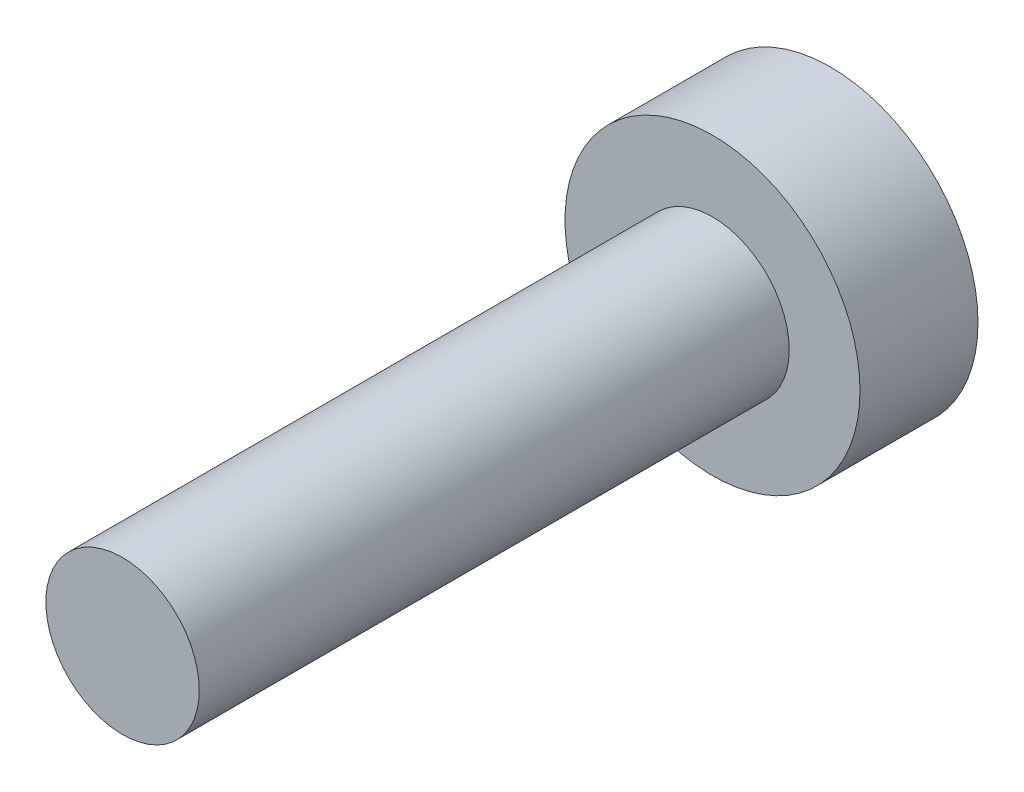
ISO-10303-21;
HEADER;
FILE_DESCRIPTION(('STEP AP214'),'2;1');
FILE_NAME('part.step','',(''),(''),'','','');
FILE_SCHEMA(('AUTOMOTIVE_DESIGN { 1 0 10303 214 1 1 1 1 }'));
ENDSEC;
DATA;
#1=APPLICATION_CONTEXT('core data for automotive mechanical design processes');
#2=APPLICATION_PROTOCOL_DEFINITION('international standard','automotive_design',2000,#1);
#3=PRODUCT_CONTEXT('',#1,'mechanical');
#4=PRODUCT('Part','Part','',(#3));
#5=PRODUCT_RELATED_PRODUCT_CATEGORY('part','',(#4));
#6=PRODUCT_DEFINITION_FORMATION('','',#4);
#7=PRODUCT_DEFINITION_CONTEXT('part definition',#1,'design');
#8=PRODUCT_DEFINITION('design','',#6,#7);
#9=PRODUCT_DEFINITION_SHAPE('','',#8);
#10=(LENGTH_UNIT() NAMED_UNIT(*) SI_UNIT(.MILLI.,.METRE.));
#11=(NAMED_UNIT(*) PLANE_ANGLE_UNIT() SI_UNIT($,.RADIAN.));
#12=(NAMED_UNIT(*) SI_UNIT($,.STERADIAN.) SOLID_ANGLE_UNIT());
#13=UNCERTAINTY_MEASURE_WITH_UNIT(LENGTH_MEASURE(1.E-05),#10,'distance_accuracy_value','');
#14=(GEOMETRIC_REPRESENTATION_CONTEXT(3) GLOBAL_UNCERTAINTY_ASSIGNED_CONTEXT((#13)) GLOBAL_UNIT_ASSIGNED_CONTEXT((#10,
#11,#12)) REPRESENTATION_CONTEXT('',''));
#15=CARTESIAN_POINT('',(0.,0.,0.));
#16=DIRECTION('',(0.,0.,1.));
#17=DIRECTION('',(1.,0.,0.));
#18=AXIS2_PLACEMENT_3D('',#15,#16,#17);
#19=CARTESIAN_POINT('',(0.,0.,10.));
#20=DIRECTION('',(0.,0.,-1.));
#21=DIRECTION('',(-1.,0.,0.));
#22=AXIS2_PLACEMENT_3D('',#19,#20,#21);
#23=CYLINDRICAL_SURFACE('',#22,1.3);
#24=CARTESIAN_POINT('',(0.,0.,10.));
#25=DIRECTION('',(0.,0.,1.));
#26=DIRECTION('',(1.,0.,0.));
#27=AXIS2_PLACEMENT_3D('',#24,#25,#26);
#28=CIRCLE('',#27,1.3);
#29=CARTESIAN_POINT('',(1.3,0.,10.));
#30=VERTEX_POINT('',#29);
#31=EDGE_CURVE('E10',#30,#30,#28,.T.);
#32=ORIENTED_EDGE('',*,*,#31,.F.);
#33=EDGE_LOOP('',(#32));
#34=FACE_BOUND('',#33,.T.);
#35=CARTESIAN_POINT('',(0.,0.,0.));
#36=DIRECTION('',(0.,0.,1.));
#37=DIRECTION('',(1.,0.,0.));
#38=AXIS2_PLACEMENT_3D('',#35,#36,#37);
#39=CIRCLE('',#38,1.3);
#40=CARTESIAN_POINT('',(1.3,0.,0.));
#41=VERTEX_POINT('',#40);
#42=EDGE_CURVE('E34',#41,#41,#39,.T.);
#43=ORIENTED_EDGE('',*,*,#42,.T.);
#44=EDGE_LOOP('',(#43));
#45=FACE_BOUND('',#44,.T.);
#46=ADVANCED_FACE('F31',(#34,#45),#23,.T.);
#47=CARTESIAN_POINT('',(0.,0.,10.));
#48=DIRECTION('',(0.,0.,1.));
#49=DIRECTION('',(1.,0.,0.));
#50=AXIS2_PLACEMENT_3D('',#47,#48,#49);
#51=PLANE('',#50);
#52=ORIENTED_EDGE('',*,*,#31,.T.);
#53=EDGE_LOOP('',(#52));
#54=FACE_BOUND('',#53,.T.);
#55=ADVANCED_FACE('F62',(#54),#51,.T.);
#56=CARTESIAN_POINT('',(0.,0.,-2.));
#57=DIRECTION('',(0.,0.,1.));
#58=DIRECTION('',(1.,0.,0.));
#59=AXIS2_PLACEMENT_3D('',#56,#57,#58);
#60=CYLINDRICAL_SURFACE('',#59,2.5);
#61=CARTESIAN_POINT('',(0.,0.,-2.));
#62=DIRECTION('',(0.,0.,1.));
#63=DIRECTION('',(1.,0.,0.));
#64=AXIS2_PLACEMENT_3D('',#61,#62,#63);
#65=CIRCLE('',#64,2.5);
#66=CARTESIAN_POINT('',(2.5,0.,-2.));
#67=VERTEX_POINT('',#66);
#68=EDGE_CURVE('E41',#67,#67,#65,.T.);
#69=ORIENTED_EDGE('',*,*,#68,.T.);
#70=EDGE_LOOP('',(#69));
#71=FACE_BOUND('',#70,.T.);
#72=CARTESIAN_POINT('',(0.,0.,0.));
#73=DIRECTION('',(0.,0.,1.));
#74=DIRECTION('',(1.,0.,0.));
#75=AXIS2_PLACEMENT_3D('',#72,#73,#74);
#76=CIRCLE('',#75,2.5);
#77=CARTESIAN_POINT('',(2.5,0.,0.));
#78=VERTEX_POINT('',#77);
#79=EDGE_CURVE('E43',#78,#78,#76,.T.);
#80=ORIENTED_EDGE('',*,*,#79,.F.);
#81=EDGE_LOOP('',(#80));
#82=FACE_BOUND('',#81,.T.);
#83=ADVANCED_FACE('F49',(#71,#82),#60,.T.);
#84=CARTESIAN_POINT('',(0.,0.,-2.));
#85=DIRECTION('',(0.,0.,1.));
#86=DIRECTION('',(1.,0.,0.));
#87=AXIS2_PLACEMENT_3D('',#84,#85,#86);
#88=PLANE('',#87);
#89=ORIENTED_EDGE('',*,*,#68,.F.);
#90=EDGE_LOOP('',(#89));
#91=FACE_BOUND('',#90,.T.);
#92=ADVANCED_FACE('F52',(#91),#88,.F.);
#93=CARTESIAN_POINT('',(0.,0.,0.));
#94=DIRECTION('',(0.,0.,1.));
#95=DIRECTION('',(1.,0.,0.));
#96=AXIS2_PLACEMENT_3D('',#93,#94,#95);
#97=PLANE('',#96);
#98=ORIENTED_EDGE('',*,*,#42,.F.);
#99=EDGE_LOOP('',(#98));
#100=FACE_BOUND('',#99,.T.);
#101=ORIENTED_EDGE('',*,*,#79,.T.);
#102=EDGE_LOOP('',(#101));
#103=FACE_BOUND('',#102,.T.);
#104=ADVANCED_FACE('F54',(#100,#103),#97,.T.);
#105=CLOSED_SHELL('',(#46,#55,#83,#92,#104));
#106=MANIFOLD_SOLID_BREP('B2',#105);
#107=ADVANCED_BREP_SHAPE_REPRESENTATION('',(#18,#106),#14);
#108=SHAPE_DEFINITION_REPRESENTATION(#9,#107);
ENDSEC;
END-ISO-10303-21;
